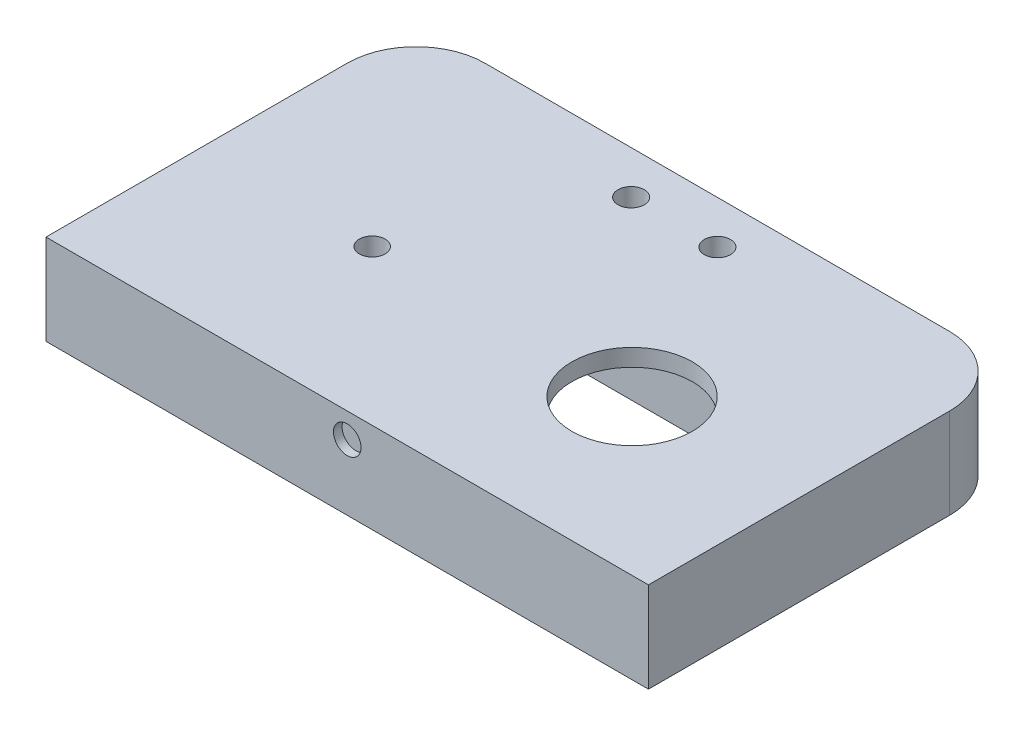
ISO-10303-21;
HEADER;
FILE_DESCRIPTION(('STEP AP214'),'2;1');
FILE_NAME('part.step','',(''),(''),'','','');
FILE_SCHEMA(('AUTOMOTIVE_DESIGN { 1 0 10303 214 1 1 1 1 }'));
ENDSEC;
DATA;
#1=APPLICATION_CONTEXT('core data for automotive mechanical design processes');
#2=APPLICATION_PROTOCOL_DEFINITION('international standard','automotive_design',2000,#1);
#3=PRODUCT_CONTEXT('',#1,'mechanical');
#4=PRODUCT('Part','Part','',(#3));
#5=PRODUCT_RELATED_PRODUCT_CATEGORY('part','',(#4));
#6=PRODUCT_DEFINITION_FORMATION('','',#4);
#7=PRODUCT_DEFINITION_CONTEXT('part definition',#1,'design');
#8=PRODUCT_DEFINITION('design','',#6,#7);
#9=PRODUCT_DEFINITION_SHAPE('','',#8);
#10=(LENGTH_UNIT() NAMED_UNIT(*) SI_UNIT(.MILLI.,.METRE.));
#11=(NAMED_UNIT(*) PLANE_ANGLE_UNIT() SI_UNIT($,.RADIAN.));
#12=(NAMED_UNIT(*) SI_UNIT($,.STERADIAN.) SOLID_ANGLE_UNIT());
#13=UNCERTAINTY_MEASURE_WITH_UNIT(LENGTH_MEASURE(1.E-05),#10,'distance_accuracy_value','');
#14=(GEOMETRIC_REPRESENTATION_CONTEXT(3) GLOBAL_UNCERTAINTY_ASSIGNED_CONTEXT((#13)) GLOBAL_UNIT_ASSIGNED_CONTEXT((#10,
#11,#12)) REPRESENTATION_CONTEXT('',''));
#15=CARTESIAN_POINT('',(0.,0.,0.));
#16=DIRECTION('',(0.,0.,1.));
#17=DIRECTION('',(1.,0.,0.));
#18=AXIS2_PLACEMENT_3D('',#15,#16,#17);
#19=CARTESIAN_POINT('',(15.1,14.5,0.));
#20=DIRECTION('',(0.,-1.,0.));
#21=DIRECTION('',(0.,0.,-1.));
#22=AXIS2_PLACEMENT_3D('',#19,#20,#21);
#23=CYLINDRICAL_SURFACE('',#22,7.);
#24=CARTESIAN_POINT('',(15.1,10.5,0.));
#25=DIRECTION('',(0.,1.,0.));
#26=DIRECTION('',(0.,0.,1.));
#27=AXIS2_PLACEMENT_3D('',#24,#25,#26);
#28=CIRCLE('',#27,7.);
#29=CARTESIAN_POINT('',(15.1,10.5,7.));
#30=VERTEX_POINT('',#29);
#31=EDGE_CURVE('E294',#30,#30,#28,.T.);
#32=ORIENTED_EDGE('',*,*,#31,.T.);
#33=EDGE_LOOP('',(#32));
#34=FACE_BOUND('',#33,.T.);
#35=CARTESIAN_POINT('',(15.1,8.5,0.));
#36=DIRECTION('',(0.,-1.,0.));
#37=DIRECTION('',(0.,0.,-1.));
#38=AXIS2_PLACEMENT_3D('',#35,#36,#37);
#39=CIRCLE('',#38,7.);
#40=CARTESIAN_POINT('',(15.1,8.5,-7.));
#41=VERTEX_POINT('',#40);
#42=EDGE_CURVE('E291',#41,#41,#39,.F.);
#43=ORIENTED_EDGE('',*,*,#42,.F.);
#44=EDGE_LOOP('',(#43));
#45=FACE_BOUND('',#44,.T.);
#46=ADVANCED_FACE('F38',(#34,#45),#23,.F.);
#47=CARTESIAN_POINT('',(-35.,10.5,-25.));
#48=DIRECTION('',(1.,0.,0.));
#49=DIRECTION('',(0.,0.,-1.));
#50=AXIS2_PLACEMENT_3D('',#47,#48,#49);
#51=PLANE('',#50);
#52=DIRECTION('',(0.,0.,1.));
#53=VECTOR('',#52,1.);
#54=CARTESIAN_POINT('',(-35.,10.5,-25.));
#55=LINE('',#54,#53);
#56=CARTESIAN_POINT('',(-35.,10.5,-17.));
#57=VERTEX_POINT('',#56);
#58=CARTESIAN_POINT('',(-35.,10.5,18.));
#59=VERTEX_POINT('',#58);
#60=EDGE_CURVE('E335',#57,#59,#55,.T.);
#61=ORIENTED_EDGE('',*,*,#60,.F.);
#62=DIRECTION('',(0.,-1.,0.));
#63=VECTOR('',#62,1.);
#64=CARTESIAN_POINT('',(-35.,10.5,-17.));
#65=LINE('',#64,#63);
#66=CARTESIAN_POINT('',(-35.,0.,-17.));
#67=VERTEX_POINT('',#66);
#68=EDGE_CURVE('E374',#57,#67,#65,.T.);
#69=ORIENTED_EDGE('',*,*,#68,.T.);
#70=DIRECTION('',(0.,0.,1.));
#71=VECTOR('',#70,1.);
#72=CARTESIAN_POINT('',(-35.,0.,-25.));
#73=LINE('',#72,#71);
#74=CARTESIAN_POINT('',(-35.,0.,18.));
#75=VERTEX_POINT('',#74);
#76=EDGE_CURVE('E345',#67,#75,#73,.T.);
#77=ORIENTED_EDGE('',*,*,#76,.T.);
#78=DIRECTION('',(0.,-1.,0.));
#79=VECTOR('',#78,1.);
#80=CARTESIAN_POINT('',(-35.,10.5,18.));
#81=LINE('',#80,#79);
#82=EDGE_CURVE('E355',#59,#75,#81,.T.);
#83=ORIENTED_EDGE('',*,*,#82,.F.);
#84=EDGE_LOOP('',(#61,#69,#77,#83));
#85=FACE_BOUND('',#84,.T.);
#86=ADVANCED_FACE('F418',(#85),#51,.F.);
#87=CARTESIAN_POINT('',(-35.,10.5,18.));
#88=DIRECTION('',(0.,0.,-1.));
#89=DIRECTION('',(-1.,0.,0.));
#90=AXIS2_PLACEMENT_3D('',#87,#88,#89);
#91=PLANE('',#90);
#92=CARTESIAN_POINT('',(0.,7.60744348376086,18.));
#93=DIRECTION('',(0.,0.,1.));
#94=DIRECTION('',(1.,0.,0.));
#95=AXIS2_PLACEMENT_3D('',#92,#93,#94);
#96=CIRCLE('',#95,1.6);
#97=CARTESIAN_POINT('',(1.6,7.60744348376086,18.));
#98=VERTEX_POINT('',#97);
#99=EDGE_CURVE('E399',#98,#98,#96,.T.);
#100=ORIENTED_EDGE('',*,*,#99,.F.);
#101=EDGE_LOOP('',(#100));
#102=FACE_BOUND('',#101,.T.);
#103=DIRECTION('',(1.,0.,0.));
#104=VECTOR('',#103,1.);
#105=CARTESIAN_POINT('',(-35.,0.,18.));
#106=LINE('',#105,#104);
#107=CARTESIAN_POINT('',(35.,0.,18.));
#108=VERTEX_POINT('',#107);
#109=EDGE_CURVE('E347',#75,#108,#106,.T.);
#110=ORIENTED_EDGE('',*,*,#109,.T.);
#111=DIRECTION('',(0.,-1.,0.));
#112=VECTOR('',#111,1.);
#113=CARTESIAN_POINT('',(35.,10.5,18.));
#114=LINE('',#113,#112);
#115=CARTESIAN_POINT('',(35.,10.5,18.));
#116=VERTEX_POINT('',#115);
#117=EDGE_CURVE('E344',#116,#108,#114,.T.);
#118=ORIENTED_EDGE('',*,*,#117,.F.);
#119=DIRECTION('',(1.,0.,0.));
#120=VECTOR('',#119,1.);
#121=CARTESIAN_POINT('',(-35.,10.5,18.));
#122=LINE('',#121,#120);
#123=EDGE_CURVE('E337',#59,#116,#122,.T.);
#124=ORIENTED_EDGE('',*,*,#123,.F.);
#125=ORIENTED_EDGE('',*,*,#82,.T.);
#126=EDGE_LOOP('',(#110,#118,#124,#125));
#127=FACE_BOUND('',#126,.T.);
#128=ADVANCED_FACE('F414',(#102,#127),#91,.F.);
#129=CARTESIAN_POINT('',(35.,10.5,-25.));
#130=DIRECTION('',(-1.,0.,0.));
#131=DIRECTION('',(0.,0.,1.));
#132=AXIS2_PLACEMENT_3D('',#129,#130,#131);
#133=PLANE('',#132);
#134=DIRECTION('',(0.,0.,-1.));
#135=VECTOR('',#134,1.);
#136=CARTESIAN_POINT('',(35.,0.,-25.));
#137=LINE('',#136,#135);
#138=CARTESIAN_POINT('',(35.,0.,-17.));
#139=VERTEX_POINT('',#138);
#140=EDGE_CURVE('E350',#108,#139,#137,.T.);
#141=ORIENTED_EDGE('',*,*,#140,.T.);
#142=DIRECTION('',(0.,-1.,0.));
#143=VECTOR('',#142,1.);
#144=CARTESIAN_POINT('',(35.,10.5,-17.));
#145=LINE('',#144,#143);
#146=CARTESIAN_POINT('',(35.,10.5,-17.));
#147=VERTEX_POINT('',#146);
#148=EDGE_CURVE('E11',#139,#147,#145,.F.);
#149=ORIENTED_EDGE('',*,*,#148,.T.);
#150=DIRECTION('',(0.,0.,-1.));
#151=VECTOR('',#150,1.);
#152=CARTESIAN_POINT('',(35.,10.5,-25.));
#153=LINE('',#152,#151);
#154=EDGE_CURVE('E340',#116,#147,#153,.T.);
#155=ORIENTED_EDGE('',*,*,#154,.F.);
#156=ORIENTED_EDGE('',*,*,#117,.T.);
#157=EDGE_LOOP('',(#141,#149,#155,#156));
#158=FACE_BOUND('',#157,.T.);
#159=ADVANCED_FACE('F417',(#158),#133,.F.);
#160=CARTESIAN_POINT('',(-35.,10.5,-25.));
#161=DIRECTION('',(0.,0.,1.));
#162=DIRECTION('',(1.,0.,0.));
#163=AXIS2_PLACEMENT_3D('',#160,#161,#162);
#164=PLANE('',#163);
#165=DIRECTION('',(-1.,0.,0.));
#166=VECTOR('',#165,1.);
#167=CARTESIAN_POINT('',(-35.,0.,-25.));
#168=LINE('',#167,#166);
#169=CARTESIAN_POINT('',(27.,0.,-25.));
#170=VERTEX_POINT('',#169);
#171=CARTESIAN_POINT('',(-27.,0.,-25.));
#172=VERTEX_POINT('',#171);
#173=EDGE_CURVE('E338',#170,#172,#168,.T.);
#174=ORIENTED_EDGE('',*,*,#173,.T.);
#175=DIRECTION('',(0.,-1.,0.));
#176=VECTOR('',#175,1.);
#177=CARTESIAN_POINT('',(-27.,10.5,-25.));
#178=LINE('',#177,#176);
#179=CARTESIAN_POINT('',(-27.,10.5,-25.));
#180=VERTEX_POINT('',#179);
#181=EDGE_CURVE('E61',#172,#180,#178,.F.);
#182=ORIENTED_EDGE('',*,*,#181,.T.);
#183=DIRECTION('',(-1.,0.,0.));
#184=VECTOR('',#183,1.);
#185=CARTESIAN_POINT('',(-35.,10.5,-25.));
#186=LINE('',#185,#184);
#187=CARTESIAN_POINT('',(27.,10.5,-25.));
#188=VERTEX_POINT('',#187);
#189=EDGE_CURVE('E342',#188,#180,#186,.T.);
#190=ORIENTED_EDGE('',*,*,#189,.F.);
#191=DIRECTION('',(0.,-1.,0.));
#192=VECTOR('',#191,1.);
#193=CARTESIAN_POINT('',(27.,10.5,-25.));
#194=LINE('',#193,#192);
#195=EDGE_CURVE('E381',#188,#170,#194,.T.);
#196=ORIENTED_EDGE('',*,*,#195,.T.);
#197=EDGE_LOOP('',(#174,#182,#190,#196));
#198=FACE_BOUND('',#197,.T.);
#199=ADVANCED_FACE('F432',(#198),#164,.F.);
#200=CARTESIAN_POINT('',(0.,10.5,0.));
#201=DIRECTION('',(0.,1.,0.));
#202=DIRECTION('',(0.,0.,1.));
#203=AXIS2_PLACEMENT_3D('',#200,#201,#202);
#204=PLANE('',#203);
#205=CARTESIAN_POINT('',(-5.0123838296652,10.5,-20.));
#206=DIRECTION('',(0.,1.,0.));
#207=DIRECTION('',(0.,0.,1.));
#208=AXIS2_PLACEMENT_3D('',#205,#206,#207);
#209=CIRCLE('',#208,1.525);
#210=CARTESIAN_POINT('',(-5.0123838296652,10.5,-18.475));
#211=VERTEX_POINT('',#210);
#212=EDGE_CURVE('E389',#211,#211,#209,.T.);
#213=ORIENTED_EDGE('',*,*,#212,.F.);
#214=EDGE_LOOP('',(#213));
#215=FACE_BOUND('',#214,.T.);
#216=CARTESIAN_POINT('',(5.0123838296652,10.5,-20.));
#217=DIRECTION('',(0.,1.,0.));
#218=DIRECTION('',(0.,0.,-1.));
#219=AXIS2_PLACEMENT_3D('',#216,#217,#218);
#220=CIRCLE('',#219,1.525);
#221=CARTESIAN_POINT('',(5.0123838296652,10.5,-21.525));
#222=VERTEX_POINT('',#221);
#223=EDGE_CURVE('E223',#222,#222,#220,.T.);
#224=ORIENTED_EDGE('',*,*,#223,.F.);
#225=EDGE_LOOP('',(#224));
#226=FACE_BOUND('',#225,.T.);
#227=ORIENTED_EDGE('',*,*,#31,.F.);
#228=EDGE_LOOP('',(#227));
#229=FACE_BOUND('',#228,.T.);
#230=CARTESIAN_POINT('',(-15.1,10.5,0.));
#231=DIRECTION('',(0.,1.,0.));
#232=DIRECTION('',(0.,0.,-1.));
#233=AXIS2_PLACEMENT_3D('',#230,#231,#232);
#234=CIRCLE('',#233,1.5);
#235=CARTESIAN_POINT('',(-15.1,10.5,-1.5));
#236=VERTEX_POINT('',#235);
#237=EDGE_CURVE('E331',#236,#236,#234,.T.);
#238=ORIENTED_EDGE('',*,*,#237,.F.);
#239=EDGE_LOOP('',(#238));
#240=FACE_BOUND('',#239,.T.);
#241=ORIENTED_EDGE('',*,*,#189,.T.);
#242=CARTESIAN_POINT('',(-27.,10.5,-17.));
#243=DIRECTION('',(0.,1.,0.));
#244=DIRECTION('',(0.,0.,1.));
#245=AXIS2_PLACEMENT_3D('',#242,#243,#244);
#246=CIRCLE('',#245,8.);
#247=EDGE_CURVE('E47',#180,#57,#246,.T.);
#248=ORIENTED_EDGE('',*,*,#247,.T.);
#249=ORIENTED_EDGE('',*,*,#60,.T.);
#250=ORIENTED_EDGE('',*,*,#123,.T.);
#251=ORIENTED_EDGE('',*,*,#154,.T.);
#252=CARTESIAN_POINT('',(27.,10.5,-17.));
#253=DIRECTION('',(0.,1.,0.));
#254=DIRECTION('',(0.,0.,1.));
#255=AXIS2_PLACEMENT_3D('',#252,#253,#254);
#256=CIRCLE('',#255,8.);
#257=EDGE_CURVE('E385',#147,#188,#256,.T.);
#258=ORIENTED_EDGE('',*,*,#257,.T.);
#259=EDGE_LOOP('',(#241,#248,#249,#250,#251,#258));
#260=FACE_BOUND('',#259,.T.);
#261=ADVANCED_FACE('F435',(#215,#226,#229,#240,#260),#204,.T.);
#262=CARTESIAN_POINT('',(0.,0.,0.));
#263=DIRECTION('',(0.,1.,0.));
#264=DIRECTION('',(0.,0.,1.));
#265=AXIS2_PLACEMENT_3D('',#262,#263,#264);
#266=PLANE('',#265);
#267=CARTESIAN_POINT('',(-5.0123838296652,0.,-20.));
#268=DIRECTION('',(0.,1.,0.));
#269=DIRECTION('',(0.,0.,1.));
#270=AXIS2_PLACEMENT_3D('',#267,#268,#269);
#271=CIRCLE('',#270,1.525);
#272=CARTESIAN_POINT('',(-5.0123838296652,0.,-18.475));
#273=VERTEX_POINT('',#272);
#274=EDGE_CURVE('E42',#273,#273,#271,.T.);
#275=ORIENTED_EDGE('',*,*,#274,.T.);
#276=EDGE_LOOP('',(#275));
#277=FACE_BOUND('',#276,.T.);
#278=CARTESIAN_POINT('',(5.0123838296652,0.,-20.));
#279=DIRECTION('',(0.,1.,0.));
#280=DIRECTION('',(0.,0.,1.));
#281=AXIS2_PLACEMENT_3D('',#278,#279,#280);
#282=CIRCLE('',#281,1.525);
#283=CARTESIAN_POINT('',(5.0123838296652,0.,-18.475));
#284=VERTEX_POINT('',#283);
#285=EDGE_CURVE('E387',#284,#284,#282,.T.);
#286=ORIENTED_EDGE('',*,*,#285,.T.);
#287=EDGE_LOOP('',(#286));
#288=FACE_BOUND('',#287,.T.);
#289=CARTESIAN_POINT('',(-19.,0.,5.));
#290=DIRECTION('',(0.,-1.,0.));
#291=DIRECTION('',(0.,0.,1.));
#292=AXIS2_PLACEMENT_3D('',#289,#290,#291);
#293=CIRCLE('',#292,1.525);
#294=CARTESIAN_POINT('',(-19.,0.,6.525));
#295=VERTEX_POINT('',#294);
#296=EDGE_CURVE('E250',#295,#295,#293,.T.);
#297=ORIENTED_EDGE('',*,*,#296,.F.);
#298=EDGE_LOOP('',(#297));
#299=FACE_BOUND('',#298,.T.);
#300=CARTESIAN_POINT('',(-19.,0.,-5.));
#301=DIRECTION('',(0.,-1.,0.));
#302=DIRECTION('',(0.,0.,-1.));
#303=AXIS2_PLACEMENT_3D('',#300,#301,#302);
#304=CIRCLE('',#303,1.525);
#305=CARTESIAN_POINT('',(-19.,0.,-6.525));
#306=VERTEX_POINT('',#305);
#307=EDGE_CURVE('E261',#306,#306,#304,.T.);
#308=ORIENTED_EDGE('',*,*,#307,.F.);
#309=EDGE_LOOP('',(#308));
#310=FACE_BOUND('',#309,.T.);
#311=CARTESIAN_POINT('',(29.2,0.,-5.));
#312=DIRECTION('',(0.,-1.,0.));
#313=DIRECTION('',(0.,0.,1.));
#314=AXIS2_PLACEMENT_3D('',#311,#312,#313);
#315=CIRCLE('',#314,1.525);
#316=CARTESIAN_POINT('',(29.2,0.,-3.475));
#317=VERTEX_POINT('',#316);
#318=EDGE_CURVE('E255',#317,#317,#315,.T.);
#319=ORIENTED_EDGE('',*,*,#318,.F.);
#320=EDGE_LOOP('',(#319));
#321=FACE_BOUND('',#320,.T.);
#322=CARTESIAN_POINT('',(29.2,0.,5.));
#323=DIRECTION('',(0.,-1.,0.));
#324=DIRECTION('',(0.,0.,-1.));
#325=AXIS2_PLACEMENT_3D('',#322,#323,#324);
#326=CIRCLE('',#325,1.525);
#327=CARTESIAN_POINT('',(29.2,0.,3.475));
#328=VERTEX_POINT('',#327);
#329=EDGE_CURVE('E254',#328,#328,#326,.T.);
#330=ORIENTED_EDGE('',*,*,#329,.F.);
#331=EDGE_LOOP('',(#330));
#332=FACE_BOUND('',#331,.T.);
#333=CARTESIAN_POINT('',(-15.1,0.,0.));
#334=DIRECTION('',(0.,1.,0.));
#335=DIRECTION('',(0.,0.,1.));
#336=AXIS2_PLACEMENT_3D('',#333,#334,#335);
#337=CIRCLE('',#336,1.5);
#338=CARTESIAN_POINT('',(-15.4,0.,-1.46969384566991));
#339=VERTEX_POINT('',#338);
#340=CARTESIAN_POINT('',(-16.3,0.,-0.9));
#341=VERTEX_POINT('',#340);
#342=EDGE_CURVE('E348',#339,#341,#337,.T.);
#343=ORIENTED_EDGE('',*,*,#342,.T.);
#344=DIRECTION('',(1.,0.,0.));
#345=VECTOR('',#344,1.);
#346=CARTESIAN_POINT('',(-22.4,0.,-0.9));
#347=LINE('',#346,#345);
#348=CARTESIAN_POINT('',(-22.4,0.,-0.9));
#349=VERTEX_POINT('',#348);
#350=EDGE_CURVE('E218',#349,#341,#347,.T.);
#351=ORIENTED_EDGE('',*,*,#350,.F.);
#352=DIRECTION('',(0.,0.,-1.));
#353=VECTOR('',#352,1.);
#354=CARTESIAN_POINT('',(-22.4,0.,0.9));
#355=LINE('',#354,#353);
#356=CARTESIAN_POINT('',(-22.4,0.,0.9));
#357=VERTEX_POINT('',#356);
#358=EDGE_CURVE('E233',#357,#349,#355,.T.);
#359=ORIENTED_EDGE('',*,*,#358,.F.);
#360=DIRECTION('',(-1.,0.,0.));
#361=VECTOR('',#360,1.);
#362=CARTESIAN_POINT('',(-22.4,0.,0.9));
#363=LINE('',#362,#361);
#364=CARTESIAN_POINT('',(-16.3,0.,0.9));
#365=VERTEX_POINT('',#364);
#366=EDGE_CURVE('E230',#365,#357,#363,.T.);
#367=ORIENTED_EDGE('',*,*,#366,.F.);
#368=CARTESIAN_POINT('',(-15.4,0.,1.46969384566991));
#369=VERTEX_POINT('',#368);
#370=EDGE_CURVE('E334',#365,#369,#337,.T.);
#371=ORIENTED_EDGE('',*,*,#370,.T.);
#372=DIRECTION('',(0.,0.,-1.));
#373=VECTOR('',#372,1.);
#374=CARTESIAN_POINT('',(-15.4,0.,-10.1));
#375=LINE('',#374,#373);
#376=CARTESIAN_POINT('',(-15.4,0.,10.1));
#377=VERTEX_POINT('',#376);
#378=EDGE_CURVE('E307',#377,#369,#375,.T.);
#379=ORIENTED_EDGE('',*,*,#378,.F.);
#380=DIRECTION('',(-1.,0.,0.));
#381=VECTOR('',#380,1.);
#382=CARTESIAN_POINT('',(25.6,0.,10.1));
#383=LINE('',#382,#381);
#384=CARTESIAN_POINT('',(25.6,0.,10.1));
#385=VERTEX_POINT('',#384);
#386=EDGE_CURVE('E317',#385,#377,#383,.T.);
#387=ORIENTED_EDGE('',*,*,#386,.F.);
#388=DIRECTION('',(0.,0.,1.));
#389=VECTOR('',#388,1.);
#390=CARTESIAN_POINT('',(25.6,0.,-10.1));
#391=LINE('',#390,#389);
#392=CARTESIAN_POINT('',(25.6,0.,0.9));
#393=VERTEX_POINT('',#392);
#394=EDGE_CURVE('E313',#393,#385,#391,.T.);
#395=ORIENTED_EDGE('',*,*,#394,.F.);
#396=CARTESIAN_POINT('',(32.6,0.,0.9));
#397=VERTEX_POINT('',#396);
#398=EDGE_CURVE('E231',#397,#393,#363,.T.);
#399=ORIENTED_EDGE('',*,*,#398,.F.);
#400=DIRECTION('',(0.,0.,1.));
#401=VECTOR('',#400,1.);
#402=CARTESIAN_POINT('',(32.6,0.,0.9));
#403=LINE('',#402,#401);
#404=CARTESIAN_POINT('',(32.6,0.,-0.9));
#405=VERTEX_POINT('',#404);
#406=EDGE_CURVE('E198',#405,#397,#403,.T.);
#407=ORIENTED_EDGE('',*,*,#406,.F.);
#408=CARTESIAN_POINT('',(25.6,0.,-0.9));
#409=VERTEX_POINT('',#408);
#410=EDGE_CURVE('E220',#409,#405,#347,.T.);
#411=ORIENTED_EDGE('',*,*,#410,.F.);
#412=CARTESIAN_POINT('',(25.6,0.,-10.1));
#413=VERTEX_POINT('',#412);
#414=EDGE_CURVE('E314',#413,#409,#391,.T.);
#415=ORIENTED_EDGE('',*,*,#414,.F.);
#416=DIRECTION('',(1.,0.,0.));
#417=VECTOR('',#416,1.);
#418=CARTESIAN_POINT('',(25.6,0.,-10.1));
#419=LINE('',#418,#417);
#420=CARTESIAN_POINT('',(-15.4,0.,-10.1));
#421=VERTEX_POINT('',#420);
#422=EDGE_CURVE('E310',#421,#413,#419,.T.);
#423=ORIENTED_EDGE('',*,*,#422,.F.);
#424=EDGE_CURVE('E297',#339,#421,#375,.T.);
#425=ORIENTED_EDGE('',*,*,#424,.F.);
#426=EDGE_LOOP('',(#343,#351,#359,#367,#371,#379,#387,#395,#399,#407,#411,#415,#423,#425));
#427=FACE_BOUND('',#426,.T.);
#428=ORIENTED_EDGE('',*,*,#76,.F.);
#429=CARTESIAN_POINT('',(-27.,0.,-17.));
#430=DIRECTION('',(0.,1.,0.));
#431=DIRECTION('',(0.,0.,1.));
#432=AXIS2_PLACEMENT_3D('',#429,#430,#431);
#433=CIRCLE('',#432,8.);
#434=EDGE_CURVE('E379',#67,#172,#433,.F.);
#435=ORIENTED_EDGE('',*,*,#434,.T.);
#436=ORIENTED_EDGE('',*,*,#173,.F.);
#437=CARTESIAN_POINT('',(27.,0.,-17.));
#438=DIRECTION('',(0.,1.,0.));
#439=DIRECTION('',(0.,0.,1.));
#440=AXIS2_PLACEMENT_3D('',#437,#438,#439);
#441=CIRCLE('',#440,8.);
#442=EDGE_CURVE('E377',#170,#139,#441,.F.);
#443=ORIENTED_EDGE('',*,*,#442,.T.);
#444=ORIENTED_EDGE('',*,*,#140,.F.);
#445=ORIENTED_EDGE('',*,*,#109,.F.);
#446=EDGE_LOOP('',(#428,#435,#436,#443,#444,#445));
#447=FACE_BOUND('',#446,.T.);
#448=ADVANCED_FACE('F427',(#277,#288,#299,#310,#321,#332,#427,#447),#266,.F.);
#449=CARTESIAN_POINT('',(-15.1,-4.5,0.));
#450=DIRECTION('',(0.,1.,0.));
#451=DIRECTION('',(0.,0.,1.));
#452=AXIS2_PLACEMENT_3D('',#449,#450,#451);
#453=CYLINDRICAL_SURFACE('',#452,1.5);
#454=ORIENTED_EDGE('',*,*,#237,.T.);
#455=EDGE_LOOP('',(#454));
#456=FACE_BOUND('',#455,.T.);
#457=CARTESIAN_POINT('',(-15.1,2.,0.));
#458=DIRECTION('',(0.,-1.,0.));
#459=DIRECTION('',(0.,0.,-1.));
#460=AXIS2_PLACEMENT_3D('',#457,#458,#459);
#461=CIRCLE('',#460,1.5);
#462=CARTESIAN_POINT('',(-16.3,2.,-0.9));
#463=VERTEX_POINT('',#462);
#464=CARTESIAN_POINT('',(-16.3,2.,0.9));
#465=VERTEX_POINT('',#464);
#466=EDGE_CURVE('E238',#463,#465,#461,.F.);
#467=ORIENTED_EDGE('',*,*,#466,.F.);
#468=DIRECTION('',(0.,1.,0.));
#469=VECTOR('',#468,1.);
#470=CARTESIAN_POINT('',(-16.3,-4.5,-0.9));
#471=LINE('',#470,#469);
#472=EDGE_CURVE('E247',#463,#341,#471,.F.);
#473=ORIENTED_EDGE('',*,*,#472,.T.);
#474=ORIENTED_EDGE('',*,*,#342,.F.);
#475=DIRECTION('',(0.,1.,0.));
#476=VECTOR('',#475,1.);
#477=CARTESIAN_POINT('',(-15.4,-4.5,-1.46969384566991));
#478=LINE('',#477,#476);
#479=CARTESIAN_POINT('',(-15.4,6.,-1.46969384566991));
#480=VERTEX_POINT('',#479);
#481=EDGE_CURVE('E358',#339,#480,#478,.T.);
#482=ORIENTED_EDGE('',*,*,#481,.T.);
#483=CARTESIAN_POINT('',(-15.1,6.,0.));
#484=DIRECTION('',(0.,-1.,0.));
#485=DIRECTION('',(0.,0.,-1.));
#486=AXIS2_PLACEMENT_3D('',#483,#484,#485);
#487=CIRCLE('',#486,1.5);
#488=CARTESIAN_POINT('',(-15.4,6.,1.46969384566991));
#489=VERTEX_POINT('',#488);
#490=EDGE_CURVE('E322',#489,#480,#487,.F.);
#491=ORIENTED_EDGE('',*,*,#490,.F.);
#492=DIRECTION('',(0.,1.,0.));
#493=VECTOR('',#492,1.);
#494=CARTESIAN_POINT('',(-15.4,-4.5,1.46969384566991));
#495=LINE('',#494,#493);
#496=EDGE_CURVE('E363',#489,#369,#495,.F.);
#497=ORIENTED_EDGE('',*,*,#496,.T.);
#498=ORIENTED_EDGE('',*,*,#370,.F.);
#499=DIRECTION('',(0.,1.,0.));
#500=VECTOR('',#499,1.);
#501=CARTESIAN_POINT('',(-16.3,-4.5,0.9));
#502=LINE('',#501,#500);
#503=EDGE_CURVE('E244',#365,#465,#502,.T.);
#504=ORIENTED_EDGE('',*,*,#503,.T.);
#505=EDGE_LOOP('',(#467,#473,#474,#482,#491,#497,#498,#504));
#506=FACE_BOUND('',#505,.T.);
#507=ADVANCED_FACE('F535',(#456,#506),#453,.F.);
#508=CARTESIAN_POINT('',(-15.4,6.,-10.1));
#509=DIRECTION('',(-1.,0.,0.));
#510=DIRECTION('',(0.,0.,1.));
#511=AXIS2_PLACEMENT_3D('',#508,#509,#510);
#512=PLANE('',#511);
#513=DIRECTION('',(0.,0.,-1.));
#514=VECTOR('',#513,1.);
#515=CARTESIAN_POINT('',(-15.4,6.,-10.1));
#516=LINE('',#515,#514);
#517=CARTESIAN_POINT('',(-15.4,6.,10.1));
#518=VERTEX_POINT('',#517);
#519=EDGE_CURVE('E298',#518,#489,#516,.T.);
#520=ORIENTED_EDGE('',*,*,#519,.F.);
#521=DIRECTION('',(0.,-1.,0.));
#522=VECTOR('',#521,1.);
#523=CARTESIAN_POINT('',(-15.4,6.,10.1));
#524=LINE('',#523,#522);
#525=EDGE_CURVE('E320',#518,#377,#524,.T.);
#526=ORIENTED_EDGE('',*,*,#525,.T.);
#527=ORIENTED_EDGE('',*,*,#378,.T.);
#528=ORIENTED_EDGE('',*,*,#496,.F.);
#529=EDGE_LOOP('',(#520,#526,#527,#528));
#530=FACE_BOUND('',#529,.T.);
#531=ADVANCED_FACE('F532',(#530),#512,.F.);
#532=ORIENTED_EDGE('',*,*,#424,.T.);
#533=DIRECTION('',(0.,-1.,0.));
#534=VECTOR('',#533,1.);
#535=CARTESIAN_POINT('',(-15.4,6.,-10.1));
#536=LINE('',#535,#534);
#537=CARTESIAN_POINT('',(-15.4,6.,-10.1));
#538=VERTEX_POINT('',#537);
#539=EDGE_CURVE('E306',#538,#421,#536,.T.);
#540=ORIENTED_EDGE('',*,*,#539,.F.);
#541=EDGE_CURVE('E301',#480,#538,#516,.T.);
#542=ORIENTED_EDGE('',*,*,#541,.F.);
#543=ORIENTED_EDGE('',*,*,#481,.F.);
#544=EDGE_LOOP('',(#532,#540,#542,#543));
#545=FACE_BOUND('',#544,.T.);
#546=ADVANCED_FACE('F520',(#545),#512,.F.);
#547=CARTESIAN_POINT('',(0.,6.,0.));
#548=DIRECTION('',(0.,-1.,0.));
#549=DIRECTION('',(0.,0.,-1.));
#550=AXIS2_PLACEMENT_3D('',#547,#548,#549);
#551=PLANE('',#550);
#552=DIRECTION('',(0.,0.,-1.));
#553=VECTOR('',#552,1.);
#554=CARTESIAN_POINT('',(-13.4,6.,10.1));
#555=LINE('',#554,#553);
#556=CARTESIAN_POINT('',(-13.4,6.,10.1));
#557=VERTEX_POINT('',#556);
#558=CARTESIAN_POINT('',(-13.4,6.,-10.1));
#559=VERTEX_POINT('',#558);
#560=EDGE_CURVE('E272',#557,#559,#555,.T.);
#561=ORIENTED_EDGE('',*,*,#560,.F.);
#562=DIRECTION('',(-1.,0.,0.));
#563=VECTOR('',#562,1.);
#564=CARTESIAN_POINT('',(25.6,6.,10.1));
#565=LINE('',#564,#563);
#566=EDGE_CURVE('E304',#557,#518,#565,.T.);
#567=ORIENTED_EDGE('',*,*,#566,.T.);
#568=ORIENTED_EDGE('',*,*,#519,.T.);
#569=ORIENTED_EDGE('',*,*,#490,.T.);
#570=ORIENTED_EDGE('',*,*,#541,.T.);
#571=DIRECTION('',(1.,0.,0.));
#572=VECTOR('',#571,1.);
#573=CARTESIAN_POINT('',(25.6,6.,-10.1));
#574=LINE('',#573,#572);
#575=EDGE_CURVE('E300',#538,#559,#574,.T.);
#576=ORIENTED_EDGE('',*,*,#575,.T.);
#577=EDGE_LOOP('',(#561,#567,#568,#569,#570,#576));
#578=FACE_BOUND('',#577,.T.);
#579=ADVANCED_FACE('F516',(#578),#551,.T.);
#580=CARTESIAN_POINT('',(25.6,6.,10.1));
#581=DIRECTION('',(0.,0.,1.));
#582=DIRECTION('',(1.,0.,0.));
#583=AXIS2_PLACEMENT_3D('',#580,#581,#582);
#584=PLANE('',#583);
#585=ORIENTED_EDGE('',*,*,#386,.T.);
#586=ORIENTED_EDGE('',*,*,#525,.F.);
#587=ORIENTED_EDGE('',*,*,#566,.F.);
#588=DIRECTION('',(0.,-1.,0.));
#589=VECTOR('',#588,1.);
#590=CARTESIAN_POINT('',(-13.4,8.5,10.1));
#591=LINE('',#590,#589);
#592=CARTESIAN_POINT('',(-13.4,8.5,10.1));
#593=VERTEX_POINT('',#592);
#594=EDGE_CURVE('E289',#593,#557,#591,.T.);
#595=ORIENTED_EDGE('',*,*,#594,.F.);
#596=DIRECTION('',(-1.,0.,0.));
#597=VECTOR('',#596,1.);
#598=CARTESIAN_POINT('',(-13.4,8.5,10.1));
#599=LINE('',#598,#597);
#600=CARTESIAN_POINT('',(25.6,8.5,10.1));
#601=VERTEX_POINT('',#600);
#602=EDGE_CURVE('E284',#601,#593,#599,.T.);
#603=ORIENTED_EDGE('',*,*,#602,.F.);
#604=DIRECTION('',(0.,-1.,0.));
#605=VECTOR('',#604,1.);
#606=CARTESIAN_POINT('',(25.6,6.,10.1));
#607=LINE('',#606,#605);
#608=EDGE_CURVE('E323',#601,#385,#607,.T.);
#609=ORIENTED_EDGE('',*,*,#608,.T.);
#610=EDGE_LOOP('',(#585,#586,#587,#595,#603,#609));
#611=FACE_BOUND('',#610,.T.);
#612=ADVANCED_FACE('F519',(#611),#584,.F.);
#613=CARTESIAN_POINT('',(25.6,6.,-10.1));
#614=DIRECTION('',(1.,0.,0.));
#615=DIRECTION('',(0.,0.,-1.));
#616=AXIS2_PLACEMENT_3D('',#613,#614,#615);
#617=PLANE('',#616);
#618=ORIENTED_EDGE('',*,*,#414,.T.);
#619=DIRECTION('',(0.,1.,0.));
#620=VECTOR('',#619,1.);
#621=CARTESIAN_POINT('',(25.6,6.,-0.9));
#622=LINE('',#621,#620);
#623=CARTESIAN_POINT('',(25.6,2.,-0.9));
#624=VERTEX_POINT('',#623);
#625=EDGE_CURVE('E371',#409,#624,#622,.T.);
#626=ORIENTED_EDGE('',*,*,#625,.T.);
#627=DIRECTION('',(0.,0.,-1.));
#628=VECTOR('',#627,1.);
#629=CARTESIAN_POINT('',(25.6,2.,-10.1));
#630=LINE('',#629,#628);
#631=CARTESIAN_POINT('',(25.6,2.,0.9));
#632=VERTEX_POINT('',#631);
#633=EDGE_CURVE('E366',#632,#624,#630,.T.);
#634=ORIENTED_EDGE('',*,*,#633,.F.);
#635=DIRECTION('',(0.,-1.,0.));
#636=VECTOR('',#635,1.);
#637=CARTESIAN_POINT('',(25.6,6.,0.9));
#638=LINE('',#637,#636);
#639=EDGE_CURVE('E208',#632,#393,#638,.T.);
#640=ORIENTED_EDGE('',*,*,#639,.T.);
#641=ORIENTED_EDGE('',*,*,#394,.T.);
#642=ORIENTED_EDGE('',*,*,#608,.F.);
#643=DIRECTION('',(0.,0.,1.));
#644=VECTOR('',#643,1.);
#645=CARTESIAN_POINT('',(25.6,8.5,10.1));
#646=LINE('',#645,#644);
#647=CARTESIAN_POINT('',(25.6,8.5,-10.1));
#648=VERTEX_POINT('',#647);
#649=EDGE_CURVE('E281',#648,#601,#646,.T.);
#650=ORIENTED_EDGE('',*,*,#649,.F.);
#651=DIRECTION('',(0.,-1.,0.));
#652=VECTOR('',#651,1.);
#653=CARTESIAN_POINT('',(25.6,6.,-10.1));
#654=LINE('',#653,#652);
#655=EDGE_CURVE('E326',#648,#413,#654,.T.);
#656=ORIENTED_EDGE('',*,*,#655,.T.);
#657=EDGE_LOOP('',(#618,#626,#634,#640,#641,#642,#650,#656));
#658=FACE_BOUND('',#657,.T.);
#659=ADVANCED_FACE('F524',(#658),#617,.F.);
#660=CARTESIAN_POINT('',(25.6,6.,-10.1));
#661=DIRECTION('',(0.,0.,-1.));
#662=DIRECTION('',(-1.,0.,0.));
#663=AXIS2_PLACEMENT_3D('',#660,#661,#662);
#664=PLANE('',#663);
#665=ORIENTED_EDGE('',*,*,#422,.T.);
#666=ORIENTED_EDGE('',*,*,#655,.F.);
#667=DIRECTION('',(1.,0.,0.));
#668=VECTOR('',#667,1.);
#669=CARTESIAN_POINT('',(-13.4,8.5,-10.1));
#670=LINE('',#669,#668);
#671=CARTESIAN_POINT('',(-13.4,8.5,-10.1));
#672=VERTEX_POINT('',#671);
#673=EDGE_CURVE('E278',#672,#648,#670,.T.);
#674=ORIENTED_EDGE('',*,*,#673,.F.);
#675=DIRECTION('',(0.,-1.,0.));
#676=VECTOR('',#675,1.);
#677=CARTESIAN_POINT('',(-13.4,8.5,-10.1));
#678=LINE('',#677,#676);
#679=EDGE_CURVE('E287',#672,#559,#678,.T.);
#680=ORIENTED_EDGE('',*,*,#679,.T.);
#681=ORIENTED_EDGE('',*,*,#575,.F.);
#682=ORIENTED_EDGE('',*,*,#539,.T.);
#683=EDGE_LOOP('',(#665,#666,#674,#680,#681,#682));
#684=FACE_BOUND('',#683,.T.);
#685=ADVANCED_FACE('F511',(#684),#664,.F.);
#686=CARTESIAN_POINT('',(0.,8.5,0.));
#687=DIRECTION('',(0.,-1.,0.));
#688=DIRECTION('',(0.,0.,-1.));
#689=AXIS2_PLACEMENT_3D('',#686,#687,#688);
#690=PLANE('',#689);
#691=DIRECTION('',(0.,0.,-1.));
#692=VECTOR('',#691,1.);
#693=CARTESIAN_POINT('',(-13.4,8.5,10.1));
#694=LINE('',#693,#692);
#695=EDGE_CURVE('E275',#593,#672,#694,.T.);
#696=ORIENTED_EDGE('',*,*,#695,.T.);
#697=ORIENTED_EDGE('',*,*,#673,.T.);
#698=ORIENTED_EDGE('',*,*,#649,.T.);
#699=ORIENTED_EDGE('',*,*,#602,.T.);
#700=EDGE_LOOP('',(#696,#697,#698,#699));
#701=FACE_BOUND('',#700,.T.);
#702=ORIENTED_EDGE('',*,*,#42,.T.);
#703=EDGE_LOOP('',(#702));
#704=FACE_BOUND('',#703,.T.);
#705=ADVANCED_FACE('F508',(#701,#704),#690,.T.);
#706=CARTESIAN_POINT('',(-13.4,8.5,10.1));
#707=DIRECTION('',(-1.,0.,0.));
#708=DIRECTION('',(0.,0.,1.));
#709=AXIS2_PLACEMENT_3D('',#706,#707,#708);
#710=PLANE('',#709);
#711=ORIENTED_EDGE('',*,*,#560,.T.);
#712=ORIENTED_EDGE('',*,*,#679,.F.);
#713=ORIENTED_EDGE('',*,*,#695,.F.);
#714=ORIENTED_EDGE('',*,*,#594,.T.);
#715=EDGE_LOOP('',(#711,#712,#713,#714));
#716=FACE_BOUND('',#715,.T.);
#717=ADVANCED_FACE('F506',(#716),#710,.F.);
#718=CARTESIAN_POINT('',(29.2,5.,5.));
#719=DIRECTION('',(0.,-1.,0.));
#720=DIRECTION('',(0.,0.,-1.));
#721=AXIS2_PLACEMENT_3D('',#718,#719,#720);
#722=CYLINDRICAL_SURFACE('',#721,1.525);
#723=CARTESIAN_POINT('',(29.2,5.,5.));
#724=DIRECTION('',(0.,-1.,0.));
#725=DIRECTION('',(0.,0.,-1.));
#726=AXIS2_PLACEMENT_3D('',#723,#724,#725);
#727=CIRCLE('',#726,1.525);
#728=CARTESIAN_POINT('',(29.2,5.,3.475));
#729=VERTEX_POINT('',#728);
#730=EDGE_CURVE('E269',#729,#729,#727,.T.);
#731=ORIENTED_EDGE('',*,*,#730,.F.);
#732=EDGE_LOOP('',(#731));
#733=FACE_BOUND('',#732,.T.);
#734=ORIENTED_EDGE('',*,*,#329,.T.);
#735=EDGE_LOOP('',(#734));
#736=FACE_BOUND('',#735,.T.);
#737=ADVANCED_FACE('F502',(#733,#736),#722,.F.);
#738=CARTESIAN_POINT('',(29.2,5.,5.));
#739=DIRECTION('',(0.,-1.,0.));
#740=DIRECTION('',(0.,0.,-1.));
#741=AXIS2_PLACEMENT_3D('',#738,#739,#740);
#742=PLANE('',#741);
#743=ORIENTED_EDGE('',*,*,#730,.T.);
#744=EDGE_LOOP('',(#743));
#745=FACE_BOUND('',#744,.T.);
#746=ADVANCED_FACE('F483',(#745),#742,.T.);
#747=CARTESIAN_POINT('',(29.2,5.,-5.));
#748=DIRECTION('',(0.,-1.,0.));
#749=DIRECTION('',(0.,0.,-1.));
#750=AXIS2_PLACEMENT_3D('',#747,#748,#749);
#751=CYLINDRICAL_SURFACE('',#750,1.525);
#752=CARTESIAN_POINT('',(29.2,5.,-5.));
#753=DIRECTION('',(0.,-1.,0.));
#754=DIRECTION('',(0.,0.,1.));
#755=AXIS2_PLACEMENT_3D('',#752,#753,#754);
#756=CIRCLE('',#755,1.525);
#757=CARTESIAN_POINT('',(29.2,5.,-3.475));
#758=VERTEX_POINT('',#757);
#759=EDGE_CURVE('E251',#758,#758,#756,.T.);
#760=ORIENTED_EDGE('',*,*,#759,.F.);
#761=EDGE_LOOP('',(#760));
#762=FACE_BOUND('',#761,.T.);
#763=ORIENTED_EDGE('',*,*,#318,.T.);
#764=EDGE_LOOP('',(#763));
#765=FACE_BOUND('',#764,.T.);
#766=ADVANCED_FACE('F479',(#762,#765),#751,.F.);
#767=CARTESIAN_POINT('',(29.2,5.,-5.));
#768=DIRECTION('',(0.,1.,0.));
#769=DIRECTION('',(0.,0.,1.));
#770=AXIS2_PLACEMENT_3D('',#767,#768,#769);
#771=PLANE('',#770);
#772=ORIENTED_EDGE('',*,*,#759,.T.);
#773=EDGE_LOOP('',(#772));
#774=FACE_BOUND('',#773,.T.);
#775=ADVANCED_FACE('F475',(#774),#771,.F.);
#776=CARTESIAN_POINT('',(-19.,5.,-5.));
#777=DIRECTION('',(0.,-1.,0.));
#778=DIRECTION('',(0.,0.,-1.));
#779=AXIS2_PLACEMENT_3D('',#776,#777,#778);
#780=CYLINDRICAL_SURFACE('',#779,1.525);
#781=CARTESIAN_POINT('',(-19.,5.,-5.));
#782=DIRECTION('',(0.,-1.,0.));
#783=DIRECTION('',(0.,0.,-1.));
#784=AXIS2_PLACEMENT_3D('',#781,#782,#783);
#785=CIRCLE('',#784,1.525);
#786=CARTESIAN_POINT('',(-19.,5.,-6.525));
#787=VERTEX_POINT('',#786);
#788=EDGE_CURVE('E258',#787,#787,#785,.T.);
#789=ORIENTED_EDGE('',*,*,#788,.F.);
#790=EDGE_LOOP('',(#789));
#791=FACE_BOUND('',#790,.T.);
#792=ORIENTED_EDGE('',*,*,#307,.T.);
#793=EDGE_LOOP('',(#792));
#794=FACE_BOUND('',#793,.T.);
#795=ADVANCED_FACE('F478',(#791,#794),#780,.F.);
#796=CARTESIAN_POINT('',(-19.,5.,-5.));
#797=DIRECTION('',(0.,-1.,0.));
#798=DIRECTION('',(0.,0.,-1.));
#799=AXIS2_PLACEMENT_3D('',#796,#797,#798);
#800=PLANE('',#799);
#801=ORIENTED_EDGE('',*,*,#788,.T.);
#802=EDGE_LOOP('',(#801));
#803=FACE_BOUND('',#802,.T.);
#804=ADVANCED_FACE('F485',(#803),#800,.T.);
#805=CARTESIAN_POINT('',(-19.,5.,5.));
#806=DIRECTION('',(0.,-1.,0.));
#807=DIRECTION('',(0.,0.,-1.));
#808=AXIS2_PLACEMENT_3D('',#805,#806,#807);
#809=CYLINDRICAL_SURFACE('',#808,1.525);
#810=CARTESIAN_POINT('',(-19.,5.,5.));
#811=DIRECTION('',(0.,-1.,0.));
#812=DIRECTION('',(0.,0.,1.));
#813=AXIS2_PLACEMENT_3D('',#810,#811,#812);
#814=CIRCLE('',#813,1.525);
#815=CARTESIAN_POINT('',(-19.,5.,6.525));
#816=VERTEX_POINT('',#815);
#817=EDGE_CURVE('E264',#816,#816,#814,.T.);
#818=ORIENTED_EDGE('',*,*,#817,.F.);
#819=EDGE_LOOP('',(#818));
#820=FACE_BOUND('',#819,.T.);
#821=ORIENTED_EDGE('',*,*,#296,.T.);
#822=EDGE_LOOP('',(#821));
#823=FACE_BOUND('',#822,.T.);
#824=ADVANCED_FACE('F488',(#820,#823),#809,.F.);
#825=CARTESIAN_POINT('',(-19.,5.,5.));
#826=DIRECTION('',(0.,1.,0.));
#827=DIRECTION('',(0.,0.,1.));
#828=AXIS2_PLACEMENT_3D('',#825,#826,#827);
#829=PLANE('',#828);
#830=ORIENTED_EDGE('',*,*,#817,.T.);
#831=EDGE_LOOP('',(#830));
#832=FACE_BOUND('',#831,.T.);
#833=ADVANCED_FACE('F493',(#832),#829,.F.);
#834=CARTESIAN_POINT('',(0.,2.,0.));
#835=DIRECTION('',(0.,-1.,0.));
#836=DIRECTION('',(0.,0.,-1.));
#837=AXIS2_PLACEMENT_3D('',#834,#835,#836);
#838=PLANE('',#837);
#839=ORIENTED_EDGE('',*,*,#633,.T.);
#840=DIRECTION('',(1.,0.,0.));
#841=VECTOR('',#840,1.);
#842=CARTESIAN_POINT('',(-22.4,2.,-0.9));
#843=LINE('',#842,#841);
#844=CARTESIAN_POINT('',(32.6,2.,-0.9));
#845=VERTEX_POINT('',#844);
#846=EDGE_CURVE('E216',#624,#845,#843,.T.);
#847=ORIENTED_EDGE('',*,*,#846,.T.);
#848=DIRECTION('',(0.,0.,1.));
#849=VECTOR('',#848,1.);
#850=CARTESIAN_POINT('',(32.6,2.,0.9));
#851=LINE('',#850,#849);
#852=CARTESIAN_POINT('',(32.6,2.,0.9));
#853=VERTEX_POINT('',#852);
#854=EDGE_CURVE('E196',#845,#853,#851,.T.);
#855=ORIENTED_EDGE('',*,*,#854,.T.);
#856=DIRECTION('',(-1.,0.,0.));
#857=VECTOR('',#856,1.);
#858=CARTESIAN_POINT('',(-22.4,2.,0.9));
#859=LINE('',#858,#857);
#860=EDGE_CURVE('E205',#853,#632,#859,.T.);
#861=ORIENTED_EDGE('',*,*,#860,.T.);
#862=EDGE_LOOP('',(#839,#847,#855,#861));
#863=FACE_BOUND('',#862,.T.);
#864=ADVANCED_FACE('F214',(#863),#838,.T.);
#865=CARTESIAN_POINT('',(-22.4,2.,0.9));
#866=DIRECTION('',(0.,0.,1.));
#867=DIRECTION('',(1.,0.,0.));
#868=AXIS2_PLACEMENT_3D('',#865,#866,#867);
#869=PLANE('',#868);
#870=ORIENTED_EDGE('',*,*,#860,.F.);
#871=DIRECTION('',(0.,-1.,0.));
#872=VECTOR('',#871,1.);
#873=CARTESIAN_POINT('',(32.6,2.,0.9));
#874=LINE('',#873,#872);
#875=EDGE_CURVE('E191',#853,#397,#874,.T.);
#876=ORIENTED_EDGE('',*,*,#875,.T.);
#877=ORIENTED_EDGE('',*,*,#398,.T.);
#878=ORIENTED_EDGE('',*,*,#639,.F.);
#879=EDGE_LOOP('',(#870,#876,#877,#878));
#880=FACE_BOUND('',#879,.T.);
#881=ADVANCED_FACE('F206',(#880),#869,.F.);
#882=CARTESIAN_POINT('',(-22.4,2.,-0.9));
#883=DIRECTION('',(0.,0.,-1.));
#884=DIRECTION('',(-1.,0.,0.));
#885=AXIS2_PLACEMENT_3D('',#882,#883,#884);
#886=PLANE('',#885);
#887=ORIENTED_EDGE('',*,*,#410,.T.);
#888=DIRECTION('',(0.,-1.,0.));
#889=VECTOR('',#888,1.);
#890=CARTESIAN_POINT('',(32.6,2.,-0.9));
#891=LINE('',#890,#889);
#892=EDGE_CURVE('E236',#845,#405,#891,.T.);
#893=ORIENTED_EDGE('',*,*,#892,.F.);
#894=ORIENTED_EDGE('',*,*,#846,.F.);
#895=ORIENTED_EDGE('',*,*,#625,.F.);
#896=EDGE_LOOP('',(#887,#893,#894,#895));
#897=FACE_BOUND('',#896,.T.);
#898=ADVANCED_FACE('F474',(#897),#886,.F.);
#899=CARTESIAN_POINT('',(32.6,2.,0.9));
#900=DIRECTION('',(1.,0.,0.));
#901=DIRECTION('',(0.,0.,-1.));
#902=AXIS2_PLACEMENT_3D('',#899,#900,#901);
#903=PLANE('',#902);
#904=ORIENTED_EDGE('',*,*,#406,.T.);
#905=ORIENTED_EDGE('',*,*,#875,.F.);
#906=ORIENTED_EDGE('',*,*,#854,.F.);
#907=ORIENTED_EDGE('',*,*,#892,.T.);
#908=EDGE_LOOP('',(#904,#905,#906,#907));
#909=FACE_BOUND('',#908,.T.);
#910=ADVANCED_FACE('F193',(#909),#903,.F.);
#911=CARTESIAN_POINT('',(-22.4,2.,-0.9));
#912=VERTEX_POINT('',#911);
#913=EDGE_CURVE('E202',#912,#463,#843,.T.);
#914=ORIENTED_EDGE('',*,*,#913,.F.);
#915=DIRECTION('',(0.,-1.,0.));
#916=VECTOR('',#915,1.);
#917=CARTESIAN_POINT('',(-22.4,2.,-0.9));
#918=LINE('',#917,#916);
#919=EDGE_CURVE('E239',#912,#349,#918,.T.);
#920=ORIENTED_EDGE('',*,*,#919,.T.);
#921=ORIENTED_EDGE('',*,*,#350,.T.);
#922=ORIENTED_EDGE('',*,*,#472,.F.);
#923=EDGE_LOOP('',(#914,#920,#921,#922));
#924=FACE_BOUND('',#923,.T.);
#925=ADVANCED_FACE('F468',(#924),#886,.F.);
#926=ORIENTED_EDGE('',*,*,#366,.T.);
#927=DIRECTION('',(0.,-1.,0.));
#928=VECTOR('',#927,1.);
#929=CARTESIAN_POINT('',(-22.4,2.,0.9));
#930=LINE('',#929,#928);
#931=CARTESIAN_POINT('',(-22.4,2.,0.9));
#932=VERTEX_POINT('',#931);
#933=EDGE_CURVE('E201',#932,#357,#930,.T.);
#934=ORIENTED_EDGE('',*,*,#933,.F.);
#935=EDGE_CURVE('E212',#465,#932,#859,.T.);
#936=ORIENTED_EDGE('',*,*,#935,.F.);
#937=ORIENTED_EDGE('',*,*,#503,.F.);
#938=EDGE_LOOP('',(#926,#934,#936,#937));
#939=FACE_BOUND('',#938,.T.);
#940=ADVANCED_FACE('F463',(#939),#869,.F.);
#941=ORIENTED_EDGE('',*,*,#466,.T.);
#942=ORIENTED_EDGE('',*,*,#935,.T.);
#943=DIRECTION('',(0.,0.,-1.));
#944=VECTOR('',#943,1.);
#945=CARTESIAN_POINT('',(-22.4,2.,0.9));
#946=LINE('',#945,#944);
#947=EDGE_CURVE('E211',#932,#912,#946,.T.);
#948=ORIENTED_EDGE('',*,*,#947,.T.);
#949=ORIENTED_EDGE('',*,*,#913,.T.);
#950=EDGE_LOOP('',(#941,#942,#948,#949));
#951=FACE_BOUND('',#950,.T.);
#952=ADVANCED_FACE('F457',(#951),#838,.T.);
#953=CARTESIAN_POINT('',(-22.4,2.,0.9));
#954=DIRECTION('',(-1.,0.,0.));
#955=DIRECTION('',(0.,0.,1.));
#956=AXIS2_PLACEMENT_3D('',#953,#954,#955);
#957=PLANE('',#956);
#958=ORIENTED_EDGE('',*,*,#358,.T.);
#959=ORIENTED_EDGE('',*,*,#919,.F.);
#960=ORIENTED_EDGE('',*,*,#947,.F.);
#961=ORIENTED_EDGE('',*,*,#933,.T.);
#962=EDGE_LOOP('',(#958,#959,#960,#961));
#963=FACE_BOUND('',#962,.T.);
#964=ADVANCED_FACE('F451',(#963),#957,.F.);
#965=CARTESIAN_POINT('',(-27.,10.5,-17.));
#966=DIRECTION('',(0.,-1.,0.));
#967=DIRECTION('',(0.,0.,-1.));
#968=AXIS2_PLACEMENT_3D('',#965,#966,#967);
#969=CYLINDRICAL_SURFACE('',#968,8.);
#970=ORIENTED_EDGE('',*,*,#247,.F.);
#971=ORIENTED_EDGE('',*,*,#181,.F.);
#972=ORIENTED_EDGE('',*,*,#434,.F.);
#973=ORIENTED_EDGE('',*,*,#68,.F.);
#974=EDGE_LOOP('',(#970,#971,#972,#973));
#975=FACE_BOUND('',#974,.T.);
#976=ADVANCED_FACE('F439',(#975),#969,.T.);
#977=CARTESIAN_POINT('',(27.,10.5,-17.));
#978=DIRECTION('',(0.,-1.,0.));
#979=DIRECTION('',(0.,0.,-1.));
#980=AXIS2_PLACEMENT_3D('',#977,#978,#979);
#981=CYLINDRICAL_SURFACE('',#980,8.);
#982=ORIENTED_EDGE('',*,*,#257,.F.);
#983=ORIENTED_EDGE('',*,*,#148,.F.);
#984=ORIENTED_EDGE('',*,*,#442,.F.);
#985=ORIENTED_EDGE('',*,*,#195,.F.);
#986=EDGE_LOOP('',(#982,#983,#984,#985));
#987=FACE_BOUND('',#986,.T.);
#988=ADVANCED_FACE('F40',(#987),#981,.T.);
#989=CARTESIAN_POINT('',(5.0123838296652,-9.5,-20.));
#990=DIRECTION('',(0.,1.,0.));
#991=DIRECTION('',(0.,0.,1.));
#992=AXIS2_PLACEMENT_3D('',#989,#990,#991);
#993=CYLINDRICAL_SURFACE('',#992,1.525);
#994=ORIENTED_EDGE('',*,*,#223,.T.);
#995=EDGE_LOOP('',(#994));
#996=FACE_BOUND('',#995,.T.);
#997=ORIENTED_EDGE('',*,*,#285,.F.);
#998=EDGE_LOOP('',(#997));
#999=FACE_BOUND('',#998,.T.);
#1000=ADVANCED_FACE('F456',(#996,#999),#993,.F.);
#1001=CARTESIAN_POINT('',(-5.0123838296652,-9.5,-20.));
#1002=DIRECTION('',(0.,1.,0.));
#1003=DIRECTION('',(0.,0.,1.));
#1004=AXIS2_PLACEMENT_3D('',#1001,#1002,#1003);
#1005=CYLINDRICAL_SURFACE('',#1004,1.525);
#1006=ORIENTED_EDGE('',*,*,#212,.T.);
#1007=EDGE_LOOP('',(#1006));
#1008=FACE_BOUND('',#1007,.T.);
#1009=ORIENTED_EDGE('',*,*,#274,.F.);
#1010=EDGE_LOOP('',(#1009));
#1011=FACE_BOUND('',#1010,.T.);
#1012=ADVANCED_FACE('F410',(#1008,#1011),#1005,.F.);
#1013=CARTESIAN_POINT('',(0.,7.60744348376086,17.));
#1014=DIRECTION('',(0.,0.,1.));
#1015=DIRECTION('',(1.,0.,0.));
#1016=AXIS2_PLACEMENT_3D('',#1013,#1014,#1015);
#1017=CYLINDRICAL_SURFACE('',#1016,1.6);
#1018=CARTESIAN_POINT('',(0.,7.60744348376086,17.));
#1019=DIRECTION('',(0.,0.,1.));
#1020=DIRECTION('',(1.,0.,0.));
#1021=AXIS2_PLACEMENT_3D('',#1018,#1019,#1020);
#1022=CIRCLE('',#1021,1.6);
#1023=CARTESIAN_POINT('',(1.6,7.60744348376086,17.));
#1024=VERTEX_POINT('',#1023);
#1025=EDGE_CURVE('E397',#1024,#1024,#1022,.T.);
#1026=ORIENTED_EDGE('',*,*,#1025,.F.);
#1027=EDGE_LOOP('',(#1026));
#1028=FACE_BOUND('',#1027,.T.);
#1029=ORIENTED_EDGE('',*,*,#99,.T.);
#1030=EDGE_LOOP('',(#1029));
#1031=FACE_BOUND('',#1030,.T.);
#1032=ADVANCED_FACE('F407',(#1028,#1031),#1017,.F.);
#1033=CARTESIAN_POINT('',(0.,7.60744348376086,17.));
#1034=DIRECTION('',(0.,0.,1.));
#1035=DIRECTION('',(1.,0.,0.));
#1036=AXIS2_PLACEMENT_3D('',#1033,#1034,#1035);
#1037=PLANE('',#1036);
#1038=ORIENTED_EDGE('',*,*,#1025,.T.);
#1039=EDGE_LOOP('',(#1038));
#1040=FACE_BOUND('',#1039,.T.);
#1041=ADVANCED_FACE('F405',(#1040),#1037,.T.);
#1042=CLOSED_SHELL('',(#46,#86,#128,#159,#199,#261,#448,#507,#531,#546,#579,#612,#659,#685,#705,
#717,#737,#746,#766,#775,#795,#804,#824,#833,#864,#881,#898,#910,#925,#940,#952,#964,#976,#988,
#1000,#1012,#1032,#1041));
#1043=MANIFOLD_SOLID_BREP('B2',#1042);
#1044=ADVANCED_BREP_SHAPE_REPRESENTATION('',(#18,#1043),#14);
#1045=SHAPE_DEFINITION_REPRESENTATION(#9,#1044);
ENDSEC;
END-ISO-10303-21;
